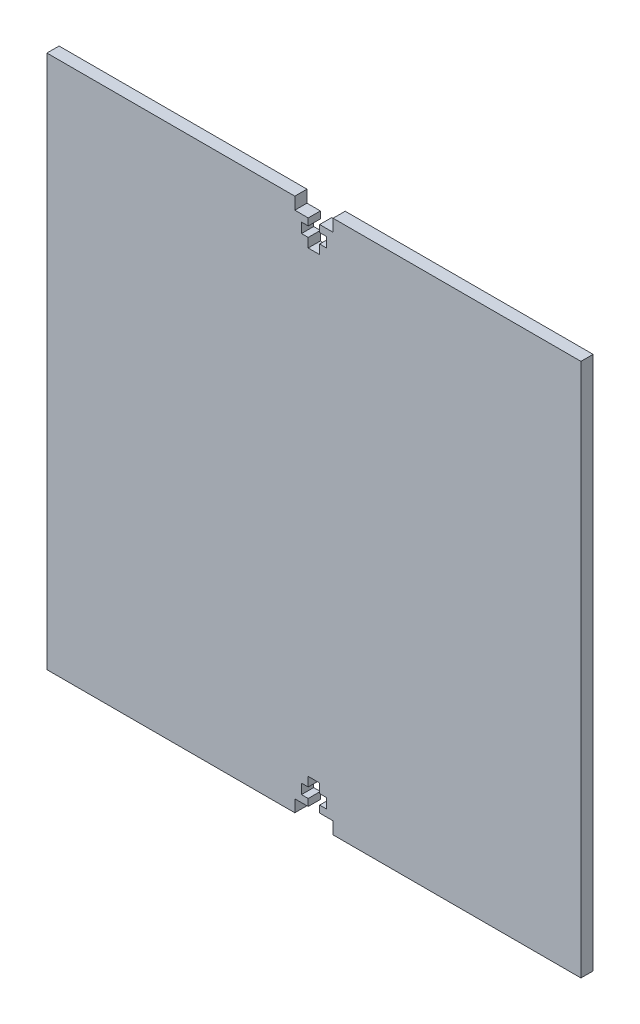
ISO-10303-21;
HEADER;
FILE_DESCRIPTION(('STEP AP214'),'2;1');
FILE_NAME('part.step','',(''),(''),'','','');
FILE_SCHEMA(('AUTOMOTIVE_DESIGN { 1 0 10303 214 1 1 1 1 }'));
ENDSEC;
DATA;
#1=APPLICATION_CONTEXT('core data for automotive mechanical design processes');
#2=APPLICATION_PROTOCOL_DEFINITION('international standard','automotive_design',2000,#1);
#3=PRODUCT_CONTEXT('',#1,'mechanical');
#4=PRODUCT('Part','Part','',(#3));
#5=PRODUCT_RELATED_PRODUCT_CATEGORY('part','',(#4));
#6=PRODUCT_DEFINITION_FORMATION('','',#4);
#7=PRODUCT_DEFINITION_CONTEXT('part definition',#1,'design');
#8=PRODUCT_DEFINITION('design','',#6,#7);
#9=PRODUCT_DEFINITION_SHAPE('','',#8);
#10=(LENGTH_UNIT() NAMED_UNIT(*) SI_UNIT(.MILLI.,.METRE.));
#11=(NAMED_UNIT(*) PLANE_ANGLE_UNIT() SI_UNIT($,.RADIAN.));
#12=(NAMED_UNIT(*) SI_UNIT($,.STERADIAN.) SOLID_ANGLE_UNIT());
#13=UNCERTAINTY_MEASURE_WITH_UNIT(LENGTH_MEASURE(1.E-05),#10,'distance_accuracy_value','');
#14=(GEOMETRIC_REPRESENTATION_CONTEXT(3) GLOBAL_UNCERTAINTY_ASSIGNED_CONTEXT((#13)) GLOBAL_UNIT_ASSIGNED_CONTEXT((#10,
#11,#12)) REPRESENTATION_CONTEXT('',''));
#15=CARTESIAN_POINT('',(0.,0.,0.));
#16=DIRECTION('',(0.,0.,1.));
#17=DIRECTION('',(1.,0.,0.));
#18=AXIS2_PLACEMENT_3D('',#15,#16,#17);
#19=CARTESIAN_POINT('',(-69.85,-69.85,3.18));
#20=DIRECTION('',(0.,1.,0.));
#21=DIRECTION('',(0.,0.,1.));
#22=AXIS2_PLACEMENT_3D('',#19,#20,#21);
#23=PLANE('',#22);
#24=DIRECTION('',(1.,0.,0.));
#25=VECTOR('',#24,1.);
#26=CARTESIAN_POINT('',(-69.85,-69.85,3.18));
#27=LINE('',#26,#25);
#28=CARTESIAN_POINT('',(4.99999999999998,-69.85,3.18));
#29=VERTEX_POINT('',#28);
#30=CARTESIAN_POINT('',(69.85,-69.85,3.18));
#31=VERTEX_POINT('',#30);
#32=EDGE_CURVE('E530',#29,#31,#27,.T.);
#33=ORIENTED_EDGE('',*,*,#32,.F.);
#34=DIRECTION('',(0.,0.,1.));
#35=VECTOR('',#34,1.);
#36=CARTESIAN_POINT('',(4.99999999999998,-69.85,0.));
#37=LINE('',#36,#35);
#38=CARTESIAN_POINT('',(4.99999999999998,-69.85,0.));
#39=VERTEX_POINT('',#38);
#40=EDGE_CURVE('E369',#39,#29,#37,.T.);
#41=ORIENTED_EDGE('',*,*,#40,.F.);
#42=DIRECTION('',(1.,0.,0.));
#43=VECTOR('',#42,1.);
#44=CARTESIAN_POINT('',(-69.85,-69.85,0.));
#45=LINE('',#44,#43);
#46=CARTESIAN_POINT('',(69.85,-69.85,0.));
#47=VERTEX_POINT('',#46);
#48=EDGE_CURVE('E289',#39,#47,#45,.T.);
#49=ORIENTED_EDGE('',*,*,#48,.T.);
#50=DIRECTION('',(0.,0.,-1.));
#51=VECTOR('',#50,1.);
#52=CARTESIAN_POINT('',(69.85,-69.85,3.18));
#53=LINE('',#52,#51);
#54=EDGE_CURVE('E534',#31,#47,#53,.T.);
#55=ORIENTED_EDGE('',*,*,#54,.F.);
#56=EDGE_LOOP('',(#33,#41,#49,#55));
#57=FACE_BOUND('',#56,.T.);
#58=ADVANCED_FACE('F35',(#57),#23,.F.);
#59=CARTESIAN_POINT('',(-69.85,69.85,3.18));
#60=DIRECTION('',(0.,-1.,0.));
#61=DIRECTION('',(0.,0.,-1.));
#62=AXIS2_PLACEMENT_3D('',#59,#60,#61);
#63=PLANE('',#62);
#64=DIRECTION('',(-1.,0.,0.));
#65=VECTOR('',#64,1.);
#66=CARTESIAN_POINT('',(-69.85,69.85,0.));
#67=LINE('',#66,#65);
#68=CARTESIAN_POINT('',(69.85,69.85,0.));
#69=VERTEX_POINT('',#68);
#70=CARTESIAN_POINT('',(4.99999999999999,69.85,0.));
#71=VERTEX_POINT('',#70);
#72=EDGE_CURVE('E538',#69,#71,#67,.T.);
#73=ORIENTED_EDGE('',*,*,#72,.T.);
#74=DIRECTION('',(0.,0.,-1.));
#75=VECTOR('',#74,1.);
#76=CARTESIAN_POINT('',(4.99999999999999,69.85,3.18));
#77=LINE('',#76,#75);
#78=CARTESIAN_POINT('',(4.99999999999999,69.85,3.18));
#79=VERTEX_POINT('',#78);
#80=EDGE_CURVE('E487',#79,#71,#77,.T.);
#81=ORIENTED_EDGE('',*,*,#80,.F.);
#82=DIRECTION('',(-1.,0.,0.));
#83=VECTOR('',#82,1.);
#84=CARTESIAN_POINT('',(-69.85,69.85,3.18));
#85=LINE('',#84,#83);
#86=CARTESIAN_POINT('',(69.85,69.85,3.18));
#87=VERTEX_POINT('',#86);
#88=EDGE_CURVE('E525',#87,#79,#85,.T.);
#89=ORIENTED_EDGE('',*,*,#88,.F.);
#90=DIRECTION('',(0.,0.,-1.));
#91=VECTOR('',#90,1.);
#92=CARTESIAN_POINT('',(69.85,69.85,3.18));
#93=LINE('',#92,#91);
#94=EDGE_CURVE('E11',#87,#69,#93,.T.);
#95=ORIENTED_EDGE('',*,*,#94,.T.);
#96=EDGE_LOOP('',(#73,#81,#89,#95));
#97=FACE_BOUND('',#96,.T.);
#98=ADVANCED_FACE('F628',(#97),#63,.F.);
#99=CARTESIAN_POINT('',(69.85,69.85,3.18));
#100=DIRECTION('',(-1.,0.,0.));
#101=DIRECTION('',(0.,-1.,0.));
#102=AXIS2_PLACEMENT_3D('',#99,#100,#101);
#103=PLANE('',#102);
#104=DIRECTION('',(0.,1.,0.));
#105=VECTOR('',#104,1.);
#106=CARTESIAN_POINT('',(69.85,69.85,0.));
#107=LINE('',#106,#105);
#108=EDGE_CURVE('E489',#47,#69,#107,.T.);
#109=ORIENTED_EDGE('',*,*,#108,.T.);
#110=ORIENTED_EDGE('',*,*,#94,.F.);
#111=DIRECTION('',(0.,1.,0.));
#112=VECTOR('',#111,1.);
#113=CARTESIAN_POINT('',(69.85,69.85,3.18));
#114=LINE('',#113,#112);
#115=EDGE_CURVE('E520',#31,#87,#114,.T.);
#116=ORIENTED_EDGE('',*,*,#115,.F.);
#117=ORIENTED_EDGE('',*,*,#54,.T.);
#118=EDGE_LOOP('',(#109,#110,#116,#117));
#119=FACE_BOUND('',#118,.T.);
#120=ADVANCED_FACE('F37',(#119),#103,.F.);
#121=CARTESIAN_POINT('',(-5.00000000000001,69.85,3.18));
#122=VERTEX_POINT('',#121);
#123=CARTESIAN_POINT('',(-69.85,69.85,3.18));
#124=VERTEX_POINT('',#123);
#125=EDGE_CURVE('E523',#122,#124,#85,.T.);
#126=ORIENTED_EDGE('',*,*,#125,.F.);
#127=DIRECTION('',(0.,0.,-1.));
#128=VECTOR('',#127,1.);
#129=CARTESIAN_POINT('',(-5.00000000000001,69.85,3.18));
#130=LINE('',#129,#128);
#131=CARTESIAN_POINT('',(-5.00000000000001,69.85,0.));
#132=VERTEX_POINT('',#131);
#133=EDGE_CURVE('E490',#122,#132,#130,.T.);
#134=ORIENTED_EDGE('',*,*,#133,.T.);
#135=CARTESIAN_POINT('',(-69.85,69.85,0.));
#136=VERTEX_POINT('',#135);
#137=EDGE_CURVE('E537',#132,#136,#67,.T.);
#138=ORIENTED_EDGE('',*,*,#137,.T.);
#139=DIRECTION('',(0.,0.,-1.));
#140=VECTOR('',#139,1.);
#141=CARTESIAN_POINT('',(-69.85,69.85,3.18));
#142=LINE('',#141,#140);
#143=EDGE_CURVE('E43',#124,#136,#142,.T.);
#144=ORIENTED_EDGE('',*,*,#143,.F.);
#145=EDGE_LOOP('',(#126,#134,#138,#144));
#146=FACE_BOUND('',#145,.T.);
#147=ADVANCED_FACE('F570',(#146),#63,.F.);
#148=CARTESIAN_POINT('',(-69.85,69.85,3.18));
#149=DIRECTION('',(1.,0.,0.));
#150=DIRECTION('',(0.,1.,0.));
#151=AXIS2_PLACEMENT_3D('',#148,#149,#150);
#152=PLANE('',#151);
#153=DIRECTION('',(0.,-1.,0.));
#154=VECTOR('',#153,1.);
#155=CARTESIAN_POINT('',(-69.85,69.85,0.));
#156=LINE('',#155,#154);
#157=CARTESIAN_POINT('',(-69.85,-69.85,0.));
#158=VERTEX_POINT('',#157);
#159=EDGE_CURVE('E541',#136,#158,#156,.T.);
#160=ORIENTED_EDGE('',*,*,#159,.T.);
#161=DIRECTION('',(0.,0.,-1.));
#162=VECTOR('',#161,1.);
#163=CARTESIAN_POINT('',(-69.85,-69.85,3.18));
#164=LINE('',#163,#162);
#165=CARTESIAN_POINT('',(-69.85,-69.85,3.18));
#166=VERTEX_POINT('',#165);
#167=EDGE_CURVE('E547',#166,#158,#164,.T.);
#168=ORIENTED_EDGE('',*,*,#167,.F.);
#169=DIRECTION('',(0.,-1.,0.));
#170=VECTOR('',#169,1.);
#171=CARTESIAN_POINT('',(-69.85,69.85,3.18));
#172=LINE('',#171,#170);
#173=EDGE_CURVE('E528',#124,#166,#172,.T.);
#174=ORIENTED_EDGE('',*,*,#173,.F.);
#175=ORIENTED_EDGE('',*,*,#143,.T.);
#176=EDGE_LOOP('',(#160,#168,#174,#175));
#177=FACE_BOUND('',#176,.T.);
#178=ADVANCED_FACE('F554',(#177),#152,.F.);
#179=CARTESIAN_POINT('',(-4.99999999999999,-69.85,0.));
#180=VERTEX_POINT('',#179);
#181=EDGE_CURVE('E524',#158,#180,#45,.T.);
#182=ORIENTED_EDGE('',*,*,#181,.T.);
#183=DIRECTION('',(0.,0.,1.));
#184=VECTOR('',#183,1.);
#185=CARTESIAN_POINT('',(-4.99999999999999,-69.85,0.));
#186=LINE('',#185,#184);
#187=CARTESIAN_POINT('',(-4.99999999999999,-69.85,3.18));
#188=VERTEX_POINT('',#187);
#189=EDGE_CURVE('E371',#180,#188,#186,.T.);
#190=ORIENTED_EDGE('',*,*,#189,.T.);
#191=EDGE_CURVE('E531',#166,#188,#27,.T.);
#192=ORIENTED_EDGE('',*,*,#191,.F.);
#193=ORIENTED_EDGE('',*,*,#167,.T.);
#194=EDGE_LOOP('',(#182,#190,#192,#193));
#195=FACE_BOUND('',#194,.T.);
#196=ADVANCED_FACE('F563',(#195),#23,.F.);
#197=CARTESIAN_POINT('',(0.,0.,3.18));
#198=DIRECTION('',(0.,0.,1.));
#199=DIRECTION('',(1.,0.,0.));
#200=AXIS2_PLACEMENT_3D('',#197,#198,#199);
#201=PLANE('',#200);
#202=DIRECTION('',(0.,1.,0.));
#203=VECTOR('',#202,1.);
#204=CARTESIAN_POINT('',(4.99999999999998,-69.85,3.18));
#205=LINE('',#204,#203);
#206=CARTESIAN_POINT('',(4.99999999999999,-66.67,3.18));
#207=VERTEX_POINT('',#206);
#208=EDGE_CURVE('E274',#29,#207,#205,.T.);
#209=ORIENTED_EDGE('',*,*,#208,.F.);
#210=ORIENTED_EDGE('',*,*,#32,.T.);
#211=ORIENTED_EDGE('',*,*,#115,.T.);
#212=ORIENTED_EDGE('',*,*,#88,.T.);
#213=DIRECTION('',(0.,-1.,0.));
#214=VECTOR('',#213,1.);
#215=CARTESIAN_POINT('',(4.99999999999999,69.85,3.18));
#216=LINE('',#215,#214);
#217=CARTESIAN_POINT('',(4.99999999999999,66.67,3.18));
#218=VERTEX_POINT('',#217);
#219=EDGE_CURVE('E399',#79,#218,#216,.T.);
#220=ORIENTED_EDGE('',*,*,#219,.T.);
#221=DIRECTION('',(-1.,0.,0.));
#222=VECTOR('',#221,1.);
#223=CARTESIAN_POINT('',(4.99999999999999,66.67,3.18));
#224=LINE('',#223,#222);
#225=CARTESIAN_POINT('',(1.49999999999999,66.67,3.18));
#226=VERTEX_POINT('',#225);
#227=EDGE_CURVE('E402',#218,#226,#224,.T.);
#228=ORIENTED_EDGE('',*,*,#227,.T.);
#229=DIRECTION('',(0.,-1.,0.));
#230=VECTOR('',#229,1.);
#231=CARTESIAN_POINT('',(1.49999999999999,66.67,3.18));
#232=LINE('',#231,#230);
#233=CARTESIAN_POINT('',(1.49999999999999,64.85,3.18));
#234=VERTEX_POINT('',#233);
#235=EDGE_CURVE('E406',#226,#234,#232,.T.);
#236=ORIENTED_EDGE('',*,*,#235,.T.);
#237=DIRECTION('',(1.,0.,0.));
#238=VECTOR('',#237,1.);
#239=CARTESIAN_POINT('',(3.24999999999999,64.85,3.18));
#240=LINE('',#239,#238);
#241=CARTESIAN_POINT('',(3.24999999999999,64.85,3.18));
#242=VERTEX_POINT('',#241);
#243=EDGE_CURVE('E409',#234,#242,#240,.T.);
#244=ORIENTED_EDGE('',*,*,#243,.T.);
#245=DIRECTION('',(0.,-1.,0.));
#246=VECTOR('',#245,1.);
#247=CARTESIAN_POINT('',(3.24999999999999,64.85,3.18));
#248=LINE('',#247,#246);
#249=CARTESIAN_POINT('',(3.24999999999999,62.25,3.18));
#250=VERTEX_POINT('',#249);
#251=EDGE_CURVE('E412',#242,#250,#248,.T.);
#252=ORIENTED_EDGE('',*,*,#251,.T.);
#253=DIRECTION('',(-1.,0.,0.));
#254=VECTOR('',#253,1.);
#255=CARTESIAN_POINT('',(3.24999999999999,62.25,3.18));
#256=LINE('',#255,#254);
#257=CARTESIAN_POINT('',(1.49999999999999,62.25,3.18));
#258=VERTEX_POINT('',#257);
#259=EDGE_CURVE('E415',#250,#258,#256,.T.);
#260=ORIENTED_EDGE('',*,*,#259,.T.);
#261=DIRECTION('',(0.,-1.,0.));
#262=VECTOR('',#261,1.);
#263=CARTESIAN_POINT('',(1.49999999999999,62.25,3.18));
#264=LINE('',#263,#262);
#265=CARTESIAN_POINT('',(1.49999999999999,59.85,3.18));
#266=VERTEX_POINT('',#265);
#267=EDGE_CURVE('E418',#258,#266,#264,.T.);
#268=ORIENTED_EDGE('',*,*,#267,.T.);
#269=DIRECTION('',(-1.,0.,0.));
#270=VECTOR('',#269,1.);
#271=CARTESIAN_POINT('',(1.49999999999999,59.85,3.18));
#272=LINE('',#271,#270);
#273=CARTESIAN_POINT('',(-1.50000000000001,59.85,3.18));
#274=VERTEX_POINT('',#273);
#275=EDGE_CURVE('E421',#266,#274,#272,.T.);
#276=ORIENTED_EDGE('',*,*,#275,.T.);
#277=DIRECTION('',(0.,1.,0.));
#278=VECTOR('',#277,1.);
#279=CARTESIAN_POINT('',(-1.50000000000001,62.25,3.18));
#280=LINE('',#279,#278);
#281=CARTESIAN_POINT('',(-1.50000000000001,62.25,3.18));
#282=VERTEX_POINT('',#281);
#283=EDGE_CURVE('E424',#274,#282,#280,.T.);
#284=ORIENTED_EDGE('',*,*,#283,.T.);
#285=DIRECTION('',(-1.,0.,0.));
#286=VECTOR('',#285,1.);
#287=CARTESIAN_POINT('',(-1.50000000000001,62.25,3.18));
#288=LINE('',#287,#286);
#289=CARTESIAN_POINT('',(-3.25000000000001,62.25,3.18));
#290=VERTEX_POINT('',#289);
#291=EDGE_CURVE('E427',#282,#290,#288,.T.);
#292=ORIENTED_EDGE('',*,*,#291,.T.);
#293=DIRECTION('',(0.,1.,0.));
#294=VECTOR('',#293,1.);
#295=CARTESIAN_POINT('',(-3.25000000000001,64.85,3.18));
#296=LINE('',#295,#294);
#297=CARTESIAN_POINT('',(-3.25000000000001,64.85,3.18));
#298=VERTEX_POINT('',#297);
#299=EDGE_CURVE('E430',#290,#298,#296,.T.);
#300=ORIENTED_EDGE('',*,*,#299,.T.);
#301=DIRECTION('',(1.,0.,0.));
#302=VECTOR('',#301,1.);
#303=CARTESIAN_POINT('',(-3.25000000000001,64.85,3.18));
#304=LINE('',#303,#302);
#305=CARTESIAN_POINT('',(-1.50000000000001,64.85,3.18));
#306=VERTEX_POINT('',#305);
#307=EDGE_CURVE('E433',#298,#306,#304,.T.);
#308=ORIENTED_EDGE('',*,*,#307,.T.);
#309=DIRECTION('',(0.,1.,0.));
#310=VECTOR('',#309,1.);
#311=CARTESIAN_POINT('',(-1.50000000000001,66.67,3.18));
#312=LINE('',#311,#310);
#313=CARTESIAN_POINT('',(-1.50000000000001,66.67,3.18));
#314=VERTEX_POINT('',#313);
#315=EDGE_CURVE('E436',#306,#314,#312,.T.);
#316=ORIENTED_EDGE('',*,*,#315,.T.);
#317=DIRECTION('',(-1.,0.,0.));
#318=VECTOR('',#317,1.);
#319=CARTESIAN_POINT('',(-1.50000000000001,66.67,3.18));
#320=LINE('',#319,#318);
#321=CARTESIAN_POINT('',(-5.00000000000001,66.67,3.18));
#322=VERTEX_POINT('',#321);
#323=EDGE_CURVE('E439',#314,#322,#320,.T.);
#324=ORIENTED_EDGE('',*,*,#323,.T.);
#325=DIRECTION('',(0.,1.,0.));
#326=VECTOR('',#325,1.);
#327=CARTESIAN_POINT('',(-5.00000000000001,69.85,3.18));
#328=LINE('',#327,#326);
#329=EDGE_CURVE('E442',#322,#122,#328,.T.);
#330=ORIENTED_EDGE('',*,*,#329,.T.);
#331=ORIENTED_EDGE('',*,*,#125,.T.);
#332=ORIENTED_EDGE('',*,*,#173,.T.);
#333=ORIENTED_EDGE('',*,*,#191,.T.);
#334=DIRECTION('',(0.,-1.,0.));
#335=VECTOR('',#334,1.);
#336=CARTESIAN_POINT('',(-4.99999999999999,-69.85,3.18));
#337=LINE('',#336,#335);
#338=CARTESIAN_POINT('',(-5.00000000000001,-66.67,3.18));
#339=VERTEX_POINT('',#338);
#340=EDGE_CURVE('E290',#339,#188,#337,.T.);
#341=ORIENTED_EDGE('',*,*,#340,.F.);
#342=DIRECTION('',(-1.,0.,0.));
#343=VECTOR('',#342,1.);
#344=CARTESIAN_POINT('',(-1.5,-66.67,3.18));
#345=LINE('',#344,#343);
#346=CARTESIAN_POINT('',(-1.5,-66.67,3.18));
#347=VERTEX_POINT('',#346);
#348=EDGE_CURVE('E292',#347,#339,#345,.T.);
#349=ORIENTED_EDGE('',*,*,#348,.F.);
#350=DIRECTION('',(0.,-1.,0.));
#351=VECTOR('',#350,1.);
#352=CARTESIAN_POINT('',(-1.5,-66.67,3.18));
#353=LINE('',#352,#351);
#354=CARTESIAN_POINT('',(-1.5,-64.85,3.18));
#355=VERTEX_POINT('',#354);
#356=EDGE_CURVE('E364',#355,#347,#353,.T.);
#357=ORIENTED_EDGE('',*,*,#356,.F.);
#358=DIRECTION('',(1.,0.,0.));
#359=VECTOR('',#358,1.);
#360=CARTESIAN_POINT('',(-3.25,-64.85,3.18));
#361=LINE('',#360,#359);
#362=CARTESIAN_POINT('',(-3.25,-64.85,3.18));
#363=VERTEX_POINT('',#362);
#364=EDGE_CURVE('E361',#363,#355,#361,.T.);
#365=ORIENTED_EDGE('',*,*,#364,.F.);
#366=DIRECTION('',(0.,-1.,0.));
#367=VECTOR('',#366,1.);
#368=CARTESIAN_POINT('',(-3.25,-64.85,3.18));
#369=LINE('',#368,#367);
#370=CARTESIAN_POINT('',(-3.25,-62.25,3.18));
#371=VERTEX_POINT('',#370);
#372=EDGE_CURVE('E358',#371,#363,#369,.T.);
#373=ORIENTED_EDGE('',*,*,#372,.F.);
#374=DIRECTION('',(-1.,0.,0.));
#375=VECTOR('',#374,1.);
#376=CARTESIAN_POINT('',(-1.5,-62.25,3.18));
#377=LINE('',#376,#375);
#378=CARTESIAN_POINT('',(-1.5,-62.25,3.18));
#379=VERTEX_POINT('',#378);
#380=EDGE_CURVE('E355',#379,#371,#377,.T.);
#381=ORIENTED_EDGE('',*,*,#380,.F.);
#382=DIRECTION('',(0.,-1.,0.));
#383=VECTOR('',#382,1.);
#384=CARTESIAN_POINT('',(-1.5,-62.25,3.18));
#385=LINE('',#384,#383);
#386=CARTESIAN_POINT('',(-1.5,-59.85,3.18));
#387=VERTEX_POINT('',#386);
#388=EDGE_CURVE('E352',#387,#379,#385,.T.);
#389=ORIENTED_EDGE('',*,*,#388,.F.);
#390=DIRECTION('',(-1.,0.,0.));
#391=VECTOR('',#390,1.);
#392=CARTESIAN_POINT('',(1.5,-59.85,3.18));
#393=LINE('',#392,#391);
#394=CARTESIAN_POINT('',(1.5,-59.85,3.18));
#395=VERTEX_POINT('',#394);
#396=EDGE_CURVE('E349',#395,#387,#393,.T.);
#397=ORIENTED_EDGE('',*,*,#396,.F.);
#398=DIRECTION('',(0.,1.,0.));
#399=VECTOR('',#398,1.);
#400=CARTESIAN_POINT('',(1.5,-62.25,3.18));
#401=LINE('',#400,#399);
#402=CARTESIAN_POINT('',(1.5,-62.25,3.18));
#403=VERTEX_POINT('',#402);
#404=EDGE_CURVE('E346',#403,#395,#401,.T.);
#405=ORIENTED_EDGE('',*,*,#404,.F.);
#406=DIRECTION('',(-1.,0.,0.));
#407=VECTOR('',#406,1.);
#408=CARTESIAN_POINT('',(3.25,-62.25,3.18));
#409=LINE('',#408,#407);
#410=CARTESIAN_POINT('',(3.25,-62.25,3.18));
#411=VERTEX_POINT('',#410);
#412=EDGE_CURVE('E343',#411,#403,#409,.T.);
#413=ORIENTED_EDGE('',*,*,#412,.F.);
#414=DIRECTION('',(0.,1.,0.));
#415=VECTOR('',#414,1.);
#416=CARTESIAN_POINT('',(3.24999999999999,-64.85,3.18));
#417=LINE('',#416,#415);
#418=CARTESIAN_POINT('',(3.24999999999999,-64.85,3.18));
#419=VERTEX_POINT('',#418);
#420=EDGE_CURVE('E340',#419,#411,#417,.T.);
#421=ORIENTED_EDGE('',*,*,#420,.F.);
#422=DIRECTION('',(1.,0.,0.));
#423=VECTOR('',#422,1.);
#424=CARTESIAN_POINT('',(3.24999999999999,-64.85,3.18));
#425=LINE('',#424,#423);
#426=CARTESIAN_POINT('',(1.5,-64.85,3.18));
#427=VERTEX_POINT('',#426);
#428=EDGE_CURVE('E337',#427,#419,#425,.T.);
#429=ORIENTED_EDGE('',*,*,#428,.F.);
#430=DIRECTION('',(0.,1.,0.));
#431=VECTOR('',#430,1.);
#432=CARTESIAN_POINT('',(1.5,-66.67,3.18));
#433=LINE('',#432,#431);
#434=CARTESIAN_POINT('',(1.5,-66.67,3.18));
#435=VERTEX_POINT('',#434);
#436=EDGE_CURVE('E334',#435,#427,#433,.T.);
#437=ORIENTED_EDGE('',*,*,#436,.F.);
#438=DIRECTION('',(-1.,0.,0.));
#439=VECTOR('',#438,1.);
#440=CARTESIAN_POINT('',(4.99999999999999,-66.67,3.18));
#441=LINE('',#440,#439);
#442=EDGE_CURVE('E332',#207,#435,#441,.T.);
#443=ORIENTED_EDGE('',*,*,#442,.F.);
#444=EDGE_LOOP('',(#209,#210,#211,#212,#220,#228,#236,#244,#252,#260,#268,#276,#284,#292,#300,
#308,#316,#324,#330,#331,#332,#333,#341,#349,#357,#365,#373,#381,#389,#397,#405,#413,#421,#429,
#437,#443));
#445=FACE_BOUND('',#444,.T.);
#446=ADVANCED_FACE('F567',(#445),#201,.T.);
#447=CARTESIAN_POINT('',(0.,0.,0.));
#448=DIRECTION('',(0.,0.,1.));
#449=DIRECTION('',(1.,0.,0.));
#450=AXIS2_PLACEMENT_3D('',#447,#448,#449);
#451=PLANE('',#450);
#452=ORIENTED_EDGE('',*,*,#48,.F.);
#453=DIRECTION('',(0.,1.,0.));
#454=VECTOR('',#453,1.);
#455=CARTESIAN_POINT('',(4.99999999999998,-69.85,0.));
#456=LINE('',#455,#454);
#457=CARTESIAN_POINT('',(4.99999999999999,-66.67,0.));
#458=VERTEX_POINT('',#457);
#459=EDGE_CURVE('E271',#39,#458,#456,.T.);
#460=ORIENTED_EDGE('',*,*,#459,.T.);
#461=DIRECTION('',(-1.,0.,0.));
#462=VECTOR('',#461,1.);
#463=CARTESIAN_POINT('',(4.99999999999999,-66.67,0.));
#464=LINE('',#463,#462);
#465=CARTESIAN_POINT('',(1.5,-66.67,0.));
#466=VERTEX_POINT('',#465);
#467=EDGE_CURVE('E282',#458,#466,#464,.T.);
#468=ORIENTED_EDGE('',*,*,#467,.T.);
#469=DIRECTION('',(0.,1.,0.));
#470=VECTOR('',#469,1.);
#471=CARTESIAN_POINT('',(1.5,-66.67,0.));
#472=LINE('',#471,#470);
#473=CARTESIAN_POINT('',(1.5,-64.85,0.));
#474=VERTEX_POINT('',#473);
#475=EDGE_CURVE('E50',#466,#474,#472,.T.);
#476=ORIENTED_EDGE('',*,*,#475,.T.);
#477=DIRECTION('',(1.,0.,0.));
#478=VECTOR('',#477,1.);
#479=CARTESIAN_POINT('',(3.24999999999999,-64.85,0.));
#480=LINE('',#479,#478);
#481=CARTESIAN_POINT('',(3.24999999999999,-64.85,0.));
#482=VERTEX_POINT('',#481);
#483=EDGE_CURVE('E296',#474,#482,#480,.T.);
#484=ORIENTED_EDGE('',*,*,#483,.T.);
#485=DIRECTION('',(0.,1.,0.));
#486=VECTOR('',#485,1.);
#487=CARTESIAN_POINT('',(3.24999999999999,-64.85,0.));
#488=LINE('',#487,#486);
#489=CARTESIAN_POINT('',(3.25,-62.25,0.));
#490=VERTEX_POINT('',#489);
#491=EDGE_CURVE('E299',#482,#490,#488,.T.);
#492=ORIENTED_EDGE('',*,*,#491,.T.);
#493=DIRECTION('',(-1.,0.,0.));
#494=VECTOR('',#493,1.);
#495=CARTESIAN_POINT('',(3.25,-62.25,0.));
#496=LINE('',#495,#494);
#497=CARTESIAN_POINT('',(1.5,-62.25,0.));
#498=VERTEX_POINT('',#497);
#499=EDGE_CURVE('E302',#490,#498,#496,.T.);
#500=ORIENTED_EDGE('',*,*,#499,.T.);
#501=DIRECTION('',(0.,1.,0.));
#502=VECTOR('',#501,1.);
#503=CARTESIAN_POINT('',(1.5,-62.25,0.));
#504=LINE('',#503,#502);
#505=CARTESIAN_POINT('',(1.5,-59.85,0.));
#506=VERTEX_POINT('',#505);
#507=EDGE_CURVE('E305',#498,#506,#504,.T.);
#508=ORIENTED_EDGE('',*,*,#507,.T.);
#509=DIRECTION('',(-1.,0.,0.));
#510=VECTOR('',#509,1.);
#511=CARTESIAN_POINT('',(1.5,-59.85,0.));
#512=LINE('',#511,#510);
#513=CARTESIAN_POINT('',(-1.5,-59.85,0.));
#514=VERTEX_POINT('',#513);
#515=EDGE_CURVE('E308',#506,#514,#512,.T.);
#516=ORIENTED_EDGE('',*,*,#515,.T.);
#517=DIRECTION('',(0.,-1.,0.));
#518=VECTOR('',#517,1.);
#519=CARTESIAN_POINT('',(-1.5,-62.25,0.));
#520=LINE('',#519,#518);
#521=CARTESIAN_POINT('',(-1.5,-62.25,0.));
#522=VERTEX_POINT('',#521);
#523=EDGE_CURVE('E311',#514,#522,#520,.T.);
#524=ORIENTED_EDGE('',*,*,#523,.T.);
#525=DIRECTION('',(-1.,0.,0.));
#526=VECTOR('',#525,1.);
#527=CARTESIAN_POINT('',(-1.5,-62.25,0.));
#528=LINE('',#527,#526);
#529=CARTESIAN_POINT('',(-3.25,-62.25,0.));
#530=VERTEX_POINT('',#529);
#531=EDGE_CURVE('E314',#522,#530,#528,.T.);
#532=ORIENTED_EDGE('',*,*,#531,.T.);
#533=DIRECTION('',(0.,-1.,0.));
#534=VECTOR('',#533,1.);
#535=CARTESIAN_POINT('',(-3.25,-64.85,0.));
#536=LINE('',#535,#534);
#537=CARTESIAN_POINT('',(-3.25,-64.85,0.));
#538=VERTEX_POINT('',#537);
#539=EDGE_CURVE('E317',#530,#538,#536,.T.);
#540=ORIENTED_EDGE('',*,*,#539,.T.);
#541=DIRECTION('',(1.,0.,0.));
#542=VECTOR('',#541,1.);
#543=CARTESIAN_POINT('',(-3.25,-64.85,0.));
#544=LINE('',#543,#542);
#545=CARTESIAN_POINT('',(-1.5,-64.85,0.));
#546=VERTEX_POINT('',#545);
#547=EDGE_CURVE('E320',#538,#546,#544,.T.);
#548=ORIENTED_EDGE('',*,*,#547,.T.);
#549=DIRECTION('',(0.,-1.,0.));
#550=VECTOR('',#549,1.);
#551=CARTESIAN_POINT('',(-1.5,-66.67,0.));
#552=LINE('',#551,#550);
#553=CARTESIAN_POINT('',(-1.5,-66.67,0.));
#554=VERTEX_POINT('',#553);
#555=EDGE_CURVE('E323',#546,#554,#552,.T.);
#556=ORIENTED_EDGE('',*,*,#555,.T.);
#557=DIRECTION('',(-1.,0.,0.));
#558=VECTOR('',#557,1.);
#559=CARTESIAN_POINT('',(-1.5,-66.67,0.));
#560=LINE('',#559,#558);
#561=CARTESIAN_POINT('',(-5.00000000000001,-66.67,0.));
#562=VERTEX_POINT('',#561);
#563=EDGE_CURVE('E326',#554,#562,#560,.T.);
#564=ORIENTED_EDGE('',*,*,#563,.T.);
#565=DIRECTION('',(0.,-1.,0.));
#566=VECTOR('',#565,1.);
#567=CARTESIAN_POINT('',(-4.99999999999999,-69.85,0.));
#568=LINE('',#567,#566);
#569=EDGE_CURVE('E279',#562,#180,#568,.T.);
#570=ORIENTED_EDGE('',*,*,#569,.T.);
#571=ORIENTED_EDGE('',*,*,#181,.F.);
#572=ORIENTED_EDGE('',*,*,#159,.F.);
#573=ORIENTED_EDGE('',*,*,#137,.F.);
#574=DIRECTION('',(0.,1.,0.));
#575=VECTOR('',#574,1.);
#576=CARTESIAN_POINT('',(-5.00000000000001,69.85,0.));
#577=LINE('',#576,#575);
#578=CARTESIAN_POINT('',(-5.00000000000001,66.67,0.));
#579=VERTEX_POINT('',#578);
#580=EDGE_CURVE('E403',#579,#132,#577,.T.);
#581=ORIENTED_EDGE('',*,*,#580,.F.);
#582=DIRECTION('',(-1.,0.,0.));
#583=VECTOR('',#582,1.);
#584=CARTESIAN_POINT('',(-1.50000000000001,66.67,0.));
#585=LINE('',#584,#583);
#586=CARTESIAN_POINT('',(-1.50000000000001,66.67,0.));
#587=VERTEX_POINT('',#586);
#588=EDGE_CURVE('E483',#587,#579,#585,.T.);
#589=ORIENTED_EDGE('',*,*,#588,.F.);
#590=DIRECTION('',(0.,1.,0.));
#591=VECTOR('',#590,1.);
#592=CARTESIAN_POINT('',(-1.50000000000001,66.67,0.));
#593=LINE('',#592,#591);
#594=CARTESIAN_POINT('',(-1.50000000000001,64.85,0.));
#595=VERTEX_POINT('',#594);
#596=EDGE_CURVE('E480',#595,#587,#593,.T.);
#597=ORIENTED_EDGE('',*,*,#596,.F.);
#598=DIRECTION('',(1.,0.,0.));
#599=VECTOR('',#598,1.);
#600=CARTESIAN_POINT('',(-3.25000000000001,64.85,0.));
#601=LINE('',#600,#599);
#602=CARTESIAN_POINT('',(-3.25000000000001,64.85,0.));
#603=VERTEX_POINT('',#602);
#604=EDGE_CURVE('E477',#603,#595,#601,.T.);
#605=ORIENTED_EDGE('',*,*,#604,.F.);
#606=DIRECTION('',(0.,1.,0.));
#607=VECTOR('',#606,1.);
#608=CARTESIAN_POINT('',(-3.25000000000001,64.85,0.));
#609=LINE('',#608,#607);
#610=CARTESIAN_POINT('',(-3.25000000000001,62.25,0.));
#611=VERTEX_POINT('',#610);
#612=EDGE_CURVE('E474',#611,#603,#609,.T.);
#613=ORIENTED_EDGE('',*,*,#612,.F.);
#614=DIRECTION('',(-1.,0.,0.));
#615=VECTOR('',#614,1.);
#616=CARTESIAN_POINT('',(-1.50000000000001,62.25,0.));
#617=LINE('',#616,#615);
#618=CARTESIAN_POINT('',(-1.50000000000001,62.25,0.));
#619=VERTEX_POINT('',#618);
#620=EDGE_CURVE('E471',#619,#611,#617,.T.);
#621=ORIENTED_EDGE('',*,*,#620,.F.);
#622=DIRECTION('',(0.,1.,0.));
#623=VECTOR('',#622,1.);
#624=CARTESIAN_POINT('',(-1.50000000000001,62.25,0.));
#625=LINE('',#624,#623);
#626=CARTESIAN_POINT('',(-1.50000000000001,59.85,0.));
#627=VERTEX_POINT('',#626);
#628=EDGE_CURVE('E468',#627,#619,#625,.T.);
#629=ORIENTED_EDGE('',*,*,#628,.F.);
#630=DIRECTION('',(-1.,0.,0.));
#631=VECTOR('',#630,1.);
#632=CARTESIAN_POINT('',(1.49999999999999,59.85,0.));
#633=LINE('',#632,#631);
#634=CARTESIAN_POINT('',(1.49999999999999,59.85,0.));
#635=VERTEX_POINT('',#634);
#636=EDGE_CURVE('E465',#635,#627,#633,.T.);
#637=ORIENTED_EDGE('',*,*,#636,.F.);
#638=DIRECTION('',(0.,-1.,0.));
#639=VECTOR('',#638,1.);
#640=CARTESIAN_POINT('',(1.49999999999999,62.25,0.));
#641=LINE('',#640,#639);
#642=CARTESIAN_POINT('',(1.49999999999999,62.25,0.));
#643=VERTEX_POINT('',#642);
#644=EDGE_CURVE('E462',#643,#635,#641,.T.);
#645=ORIENTED_EDGE('',*,*,#644,.F.);
#646=DIRECTION('',(-1.,0.,0.));
#647=VECTOR('',#646,1.);
#648=CARTESIAN_POINT('',(3.24999999999999,62.25,0.));
#649=LINE('',#648,#647);
#650=CARTESIAN_POINT('',(3.24999999999999,62.25,0.));
#651=VERTEX_POINT('',#650);
#652=EDGE_CURVE('E459',#651,#643,#649,.T.);
#653=ORIENTED_EDGE('',*,*,#652,.F.);
#654=DIRECTION('',(0.,-1.,0.));
#655=VECTOR('',#654,1.);
#656=CARTESIAN_POINT('',(3.24999999999999,64.85,0.));
#657=LINE('',#656,#655);
#658=CARTESIAN_POINT('',(3.24999999999999,64.85,0.));
#659=VERTEX_POINT('',#658);
#660=EDGE_CURVE('E456',#659,#651,#657,.T.);
#661=ORIENTED_EDGE('',*,*,#660,.F.);
#662=DIRECTION('',(1.,0.,0.));
#663=VECTOR('',#662,1.);
#664=CARTESIAN_POINT('',(3.24999999999999,64.85,0.));
#665=LINE('',#664,#663);
#666=CARTESIAN_POINT('',(1.49999999999999,64.85,0.));
#667=VERTEX_POINT('',#666);
#668=EDGE_CURVE('E453',#667,#659,#665,.T.);
#669=ORIENTED_EDGE('',*,*,#668,.F.);
#670=DIRECTION('',(0.,-1.,0.));
#671=VECTOR('',#670,1.);
#672=CARTESIAN_POINT('',(1.49999999999999,66.67,0.));
#673=LINE('',#672,#671);
#674=CARTESIAN_POINT('',(1.49999999999999,66.67,0.));
#675=VERTEX_POINT('',#674);
#676=EDGE_CURVE('E450',#675,#667,#673,.T.);
#677=ORIENTED_EDGE('',*,*,#676,.F.);
#678=DIRECTION('',(-1.,0.,0.));
#679=VECTOR('',#678,1.);
#680=CARTESIAN_POINT('',(4.99999999999999,66.67,0.));
#681=LINE('',#680,#679);
#682=CARTESIAN_POINT('',(4.99999999999999,66.67,0.));
#683=VERTEX_POINT('',#682);
#684=EDGE_CURVE('E447',#683,#675,#681,.T.);
#685=ORIENTED_EDGE('',*,*,#684,.F.);
#686=DIRECTION('',(0.,-1.,0.));
#687=VECTOR('',#686,1.);
#688=CARTESIAN_POINT('',(4.99999999999999,69.85,0.));
#689=LINE('',#688,#687);
#690=EDGE_CURVE('E58',#71,#683,#689,.T.);
#691=ORIENTED_EDGE('',*,*,#690,.F.);
#692=ORIENTED_EDGE('',*,*,#72,.F.);
#693=ORIENTED_EDGE('',*,*,#108,.F.);
#694=EDGE_LOOP('',(#452,#460,#468,#476,#484,#492,#500,#508,#516,#524,#532,#540,#548,#556,#564,
#570,#571,#572,#573,#581,#589,#597,#605,#613,#621,#629,#637,#645,#653,#661,#669,#677,#685,#691,
#692,#693));
#695=FACE_BOUND('',#694,.T.);
#696=ADVANCED_FACE('F287',(#695),#451,.F.);
#697=CARTESIAN_POINT('',(4.99999999999999,69.85,3.18));
#698=DIRECTION('',(1.,0.,0.));
#699=DIRECTION('',(0.,0.,-1.));
#700=AXIS2_PLACEMENT_3D('',#697,#698,#699);
#701=PLANE('',#700);
#702=ORIENTED_EDGE('',*,*,#690,.T.);
#703=DIRECTION('',(0.,0.,-1.));
#704=VECTOR('',#703,1.);
#705=CARTESIAN_POINT('',(4.99999999999999,66.67,3.18));
#706=LINE('',#705,#704);
#707=EDGE_CURVE('E445',#218,#683,#706,.T.);
#708=ORIENTED_EDGE('',*,*,#707,.F.);
#709=ORIENTED_EDGE('',*,*,#219,.F.);
#710=ORIENTED_EDGE('',*,*,#80,.T.);
#711=EDGE_LOOP('',(#702,#708,#709,#710));
#712=FACE_BOUND('',#711,.T.);
#713=ADVANCED_FACE('F625',(#712),#701,.F.);
#714=CARTESIAN_POINT('',(-5.00000000000001,69.85,3.18));
#715=DIRECTION('',(-1.,0.,0.));
#716=DIRECTION('',(0.,-1.,0.));
#717=AXIS2_PLACEMENT_3D('',#714,#715,#716);
#718=PLANE('',#717);
#719=ORIENTED_EDGE('',*,*,#580,.T.);
#720=ORIENTED_EDGE('',*,*,#133,.F.);
#721=ORIENTED_EDGE('',*,*,#329,.F.);
#722=DIRECTION('',(0.,0.,-1.));
#723=VECTOR('',#722,1.);
#724=CARTESIAN_POINT('',(-5.00000000000001,66.67,3.18));
#725=LINE('',#724,#723);
#726=EDGE_CURVE('E493',#322,#579,#725,.T.);
#727=ORIENTED_EDGE('',*,*,#726,.T.);
#728=EDGE_LOOP('',(#719,#720,#721,#727));
#729=FACE_BOUND('',#728,.T.);
#730=ADVANCED_FACE('F572',(#729),#718,.F.);
#731=CARTESIAN_POINT('',(-1.50000000000001,66.67,3.18));
#732=DIRECTION('',(0.,-1.,0.));
#733=DIRECTION('',(1.,0.,0.));
#734=AXIS2_PLACEMENT_3D('',#731,#732,#733);
#735=PLANE('',#734);
#736=ORIENTED_EDGE('',*,*,#588,.T.);
#737=ORIENTED_EDGE('',*,*,#726,.F.);
#738=ORIENTED_EDGE('',*,*,#323,.F.);
#739=DIRECTION('',(0.,0.,-1.));
#740=VECTOR('',#739,1.);
#741=CARTESIAN_POINT('',(-1.50000000000001,66.67,3.18));
#742=LINE('',#741,#740);
#743=EDGE_CURVE('E495',#314,#587,#742,.T.);
#744=ORIENTED_EDGE('',*,*,#743,.T.);
#745=EDGE_LOOP('',(#736,#737,#738,#744));
#746=FACE_BOUND('',#745,.T.);
#747=ADVANCED_FACE('F577',(#746),#735,.F.);
#748=CARTESIAN_POINT('',(-1.50000000000001,66.67,3.18));
#749=DIRECTION('',(-1.,0.,0.));
#750=DIRECTION('',(0.,0.,1.));
#751=AXIS2_PLACEMENT_3D('',#748,#749,#750);
#752=PLANE('',#751);
#753=ORIENTED_EDGE('',*,*,#596,.T.);
#754=ORIENTED_EDGE('',*,*,#743,.F.);
#755=ORIENTED_EDGE('',*,*,#315,.F.);
#756=DIRECTION('',(0.,0.,-1.));
#757=VECTOR('',#756,1.);
#758=CARTESIAN_POINT('',(-1.50000000000001,64.85,3.18));
#759=LINE('',#758,#757);
#760=EDGE_CURVE('E497',#306,#595,#759,.T.);
#761=ORIENTED_EDGE('',*,*,#760,.T.);
#762=EDGE_LOOP('',(#753,#754,#755,#761));
#763=FACE_BOUND('',#762,.T.);
#764=ADVANCED_FACE('F581',(#763),#752,.F.);
#765=CARTESIAN_POINT('',(-3.25000000000001,64.85,3.18));
#766=DIRECTION('',(0.,1.,0.));
#767=DIRECTION('',(0.,0.,1.));
#768=AXIS2_PLACEMENT_3D('',#765,#766,#767);
#769=PLANE('',#768);
#770=ORIENTED_EDGE('',*,*,#604,.T.);
#771=ORIENTED_EDGE('',*,*,#760,.F.);
#772=ORIENTED_EDGE('',*,*,#307,.F.);
#773=DIRECTION('',(0.,0.,-1.));
#774=VECTOR('',#773,1.);
#775=CARTESIAN_POINT('',(-3.25000000000001,64.85,3.18));
#776=LINE('',#775,#774);
#777=EDGE_CURVE('E499',#298,#603,#776,.T.);
#778=ORIENTED_EDGE('',*,*,#777,.T.);
#779=EDGE_LOOP('',(#770,#771,#772,#778));
#780=FACE_BOUND('',#779,.T.);
#781=ADVANCED_FACE('F584',(#780),#769,.F.);
#782=CARTESIAN_POINT('',(-3.25000000000001,64.85,3.18));
#783=DIRECTION('',(-1.,0.,0.));
#784=DIRECTION('',(0.,-1.,0.));
#785=AXIS2_PLACEMENT_3D('',#782,#783,#784);
#786=PLANE('',#785);
#787=ORIENTED_EDGE('',*,*,#612,.T.);
#788=ORIENTED_EDGE('',*,*,#777,.F.);
#789=ORIENTED_EDGE('',*,*,#299,.F.);
#790=DIRECTION('',(0.,0.,-1.));
#791=VECTOR('',#790,1.);
#792=CARTESIAN_POINT('',(-3.25000000000001,62.25,3.18));
#793=LINE('',#792,#791);
#794=EDGE_CURVE('E501',#290,#611,#793,.T.);
#795=ORIENTED_EDGE('',*,*,#794,.T.);
#796=EDGE_LOOP('',(#787,#788,#789,#795));
#797=FACE_BOUND('',#796,.T.);
#798=ADVANCED_FACE('F589',(#797),#786,.F.);
#799=CARTESIAN_POINT('',(-1.50000000000001,62.25,3.18));
#800=DIRECTION('',(0.,-1.,0.));
#801=DIRECTION('',(0.,0.,-1.));
#802=AXIS2_PLACEMENT_3D('',#799,#800,#801);
#803=PLANE('',#802);
#804=ORIENTED_EDGE('',*,*,#620,.T.);
#805=ORIENTED_EDGE('',*,*,#794,.F.);
#806=ORIENTED_EDGE('',*,*,#291,.F.);
#807=DIRECTION('',(0.,0.,-1.));
#808=VECTOR('',#807,1.);
#809=CARTESIAN_POINT('',(-1.50000000000001,62.25,3.18));
#810=LINE('',#809,#808);
#811=EDGE_CURVE('E503',#282,#619,#810,.T.);
#812=ORIENTED_EDGE('',*,*,#811,.T.);
#813=EDGE_LOOP('',(#804,#805,#806,#812));
#814=FACE_BOUND('',#813,.T.);
#815=ADVANCED_FACE('F593',(#814),#803,.F.);
#816=CARTESIAN_POINT('',(-1.50000000000001,62.25,3.18));
#817=DIRECTION('',(-1.,0.,0.));
#818=DIRECTION('',(0.,0.,1.));
#819=AXIS2_PLACEMENT_3D('',#816,#817,#818);
#820=PLANE('',#819);
#821=ORIENTED_EDGE('',*,*,#628,.T.);
#822=ORIENTED_EDGE('',*,*,#811,.F.);
#823=ORIENTED_EDGE('',*,*,#283,.F.);
#824=DIRECTION('',(0.,0.,-1.));
#825=VECTOR('',#824,1.);
#826=CARTESIAN_POINT('',(-1.50000000000001,59.85,3.18));
#827=LINE('',#826,#825);
#828=EDGE_CURVE('E505',#274,#627,#827,.T.);
#829=ORIENTED_EDGE('',*,*,#828,.T.);
#830=EDGE_LOOP('',(#821,#822,#823,#829));
#831=FACE_BOUND('',#830,.T.);
#832=ADVANCED_FACE('F596',(#831),#820,.F.);
#833=CARTESIAN_POINT('',(1.49999999999999,59.85,3.18));
#834=DIRECTION('',(0.,-1.,0.));
#835=DIRECTION('',(0.,0.,-1.));
#836=AXIS2_PLACEMENT_3D('',#833,#834,#835);
#837=PLANE('',#836);
#838=ORIENTED_EDGE('',*,*,#636,.T.);
#839=ORIENTED_EDGE('',*,*,#828,.F.);
#840=ORIENTED_EDGE('',*,*,#275,.F.);
#841=DIRECTION('',(0.,0.,-1.));
#842=VECTOR('',#841,1.);
#843=CARTESIAN_POINT('',(1.49999999999999,59.85,3.18));
#844=LINE('',#843,#842);
#845=EDGE_CURVE('E507',#266,#635,#844,.T.);
#846=ORIENTED_EDGE('',*,*,#845,.T.);
#847=EDGE_LOOP('',(#838,#839,#840,#846));
#848=FACE_BOUND('',#847,.T.);
#849=ADVANCED_FACE('F601',(#848),#837,.F.);
#850=CARTESIAN_POINT('',(1.49999999999999,62.25,3.18));
#851=DIRECTION('',(1.,0.,0.));
#852=DIRECTION('',(0.,0.,-1.));
#853=AXIS2_PLACEMENT_3D('',#850,#851,#852);
#854=PLANE('',#853);
#855=ORIENTED_EDGE('',*,*,#644,.T.);
#856=ORIENTED_EDGE('',*,*,#845,.F.);
#857=ORIENTED_EDGE('',*,*,#267,.F.);
#858=DIRECTION('',(0.,0.,-1.));
#859=VECTOR('',#858,1.);
#860=CARTESIAN_POINT('',(1.49999999999999,62.25,3.18));
#861=LINE('',#860,#859);
#862=EDGE_CURVE('E509',#258,#643,#861,.T.);
#863=ORIENTED_EDGE('',*,*,#862,.T.);
#864=EDGE_LOOP('',(#855,#856,#857,#863));
#865=FACE_BOUND('',#864,.T.);
#866=ADVANCED_FACE('F605',(#865),#854,.F.);
#867=CARTESIAN_POINT('',(3.24999999999999,62.25,3.18));
#868=DIRECTION('',(0.,-1.,0.));
#869=DIRECTION('',(0.,0.,-1.));
#870=AXIS2_PLACEMENT_3D('',#867,#868,#869);
#871=PLANE('',#870);
#872=ORIENTED_EDGE('',*,*,#652,.T.);
#873=ORIENTED_EDGE('',*,*,#862,.F.);
#874=ORIENTED_EDGE('',*,*,#259,.F.);
#875=DIRECTION('',(0.,0.,-1.));
#876=VECTOR('',#875,1.);
#877=CARTESIAN_POINT('',(3.24999999999999,62.25,3.18));
#878=LINE('',#877,#876);
#879=EDGE_CURVE('E511',#250,#651,#878,.T.);
#880=ORIENTED_EDGE('',*,*,#879,.T.);
#881=EDGE_LOOP('',(#872,#873,#874,#880));
#882=FACE_BOUND('',#881,.T.);
#883=ADVANCED_FACE('F608',(#882),#871,.F.);
#884=CARTESIAN_POINT('',(3.24999999999999,64.85,3.18));
#885=DIRECTION('',(1.,0.,0.));
#886=DIRECTION('',(0.,1.,0.));
#887=AXIS2_PLACEMENT_3D('',#884,#885,#886);
#888=PLANE('',#887);
#889=ORIENTED_EDGE('',*,*,#660,.T.);
#890=ORIENTED_EDGE('',*,*,#879,.F.);
#891=ORIENTED_EDGE('',*,*,#251,.F.);
#892=DIRECTION('',(0.,0.,-1.));
#893=VECTOR('',#892,1.);
#894=CARTESIAN_POINT('',(3.24999999999999,64.85,3.18));
#895=LINE('',#894,#893);
#896=EDGE_CURVE('E513',#242,#659,#895,.T.);
#897=ORIENTED_EDGE('',*,*,#896,.T.);
#898=EDGE_LOOP('',(#889,#890,#891,#897));
#899=FACE_BOUND('',#898,.T.);
#900=ADVANCED_FACE('F613',(#899),#888,.F.);
#901=CARTESIAN_POINT('',(3.24999999999999,64.85,3.18));
#902=DIRECTION('',(0.,1.,0.));
#903=DIRECTION('',(0.,0.,1.));
#904=AXIS2_PLACEMENT_3D('',#901,#902,#903);
#905=PLANE('',#904);
#906=ORIENTED_EDGE('',*,*,#668,.T.);
#907=ORIENTED_EDGE('',*,*,#896,.F.);
#908=ORIENTED_EDGE('',*,*,#243,.F.);
#909=DIRECTION('',(0.,0.,-1.));
#910=VECTOR('',#909,1.);
#911=CARTESIAN_POINT('',(1.49999999999999,64.85,3.18));
#912=LINE('',#911,#910);
#913=EDGE_CURVE('E515',#234,#667,#912,.T.);
#914=ORIENTED_EDGE('',*,*,#913,.T.);
#915=EDGE_LOOP('',(#906,#907,#908,#914));
#916=FACE_BOUND('',#915,.T.);
#917=ADVANCED_FACE('F617',(#916),#905,.F.);
#918=CARTESIAN_POINT('',(1.49999999999999,66.67,3.18));
#919=DIRECTION('',(1.,0.,0.));
#920=DIRECTION('',(0.,0.,-1.));
#921=AXIS2_PLACEMENT_3D('',#918,#919,#920);
#922=PLANE('',#921);
#923=ORIENTED_EDGE('',*,*,#676,.T.);
#924=ORIENTED_EDGE('',*,*,#913,.F.);
#925=ORIENTED_EDGE('',*,*,#235,.F.);
#926=DIRECTION('',(0.,0.,-1.));
#927=VECTOR('',#926,1.);
#928=CARTESIAN_POINT('',(1.49999999999999,66.67,3.18));
#929=LINE('',#928,#927);
#930=EDGE_CURVE('E517',#226,#675,#929,.T.);
#931=ORIENTED_EDGE('',*,*,#930,.T.);
#932=EDGE_LOOP('',(#923,#924,#925,#931));
#933=FACE_BOUND('',#932,.T.);
#934=ADVANCED_FACE('F620',(#933),#922,.F.);
#935=CARTESIAN_POINT('',(4.99999999999999,66.67,3.18));
#936=DIRECTION('',(0.,-1.,0.));
#937=DIRECTION('',(0.,0.,-1.));
#938=AXIS2_PLACEMENT_3D('',#935,#936,#937);
#939=PLANE('',#938);
#940=ORIENTED_EDGE('',*,*,#684,.T.);
#941=ORIENTED_EDGE('',*,*,#930,.F.);
#942=ORIENTED_EDGE('',*,*,#227,.F.);
#943=ORIENTED_EDGE('',*,*,#707,.T.);
#944=EDGE_LOOP('',(#940,#941,#942,#943));
#945=FACE_BOUND('',#944,.T.);
#946=ADVANCED_FACE('F623',(#945),#939,.F.);
#947=CARTESIAN_POINT('',(4.99999999999998,-69.85,0.));
#948=DIRECTION('',(1.,0.,0.));
#949=DIRECTION('',(0.,1.,0.));
#950=AXIS2_PLACEMENT_3D('',#947,#948,#949);
#951=PLANE('',#950);
#952=ORIENTED_EDGE('',*,*,#208,.T.);
#953=DIRECTION('',(0.,0.,1.));
#954=VECTOR('',#953,1.);
#955=CARTESIAN_POINT('',(4.99999999999999,-66.67,0.));
#956=LINE('',#955,#954);
#957=EDGE_CURVE('E267',#458,#207,#956,.T.);
#958=ORIENTED_EDGE('',*,*,#957,.F.);
#959=ORIENTED_EDGE('',*,*,#459,.F.);
#960=ORIENTED_EDGE('',*,*,#40,.T.);
#961=EDGE_LOOP('',(#952,#958,#959,#960));
#962=FACE_BOUND('',#961,.T.);
#963=ADVANCED_FACE('F269',(#962),#951,.F.);
#964=CARTESIAN_POINT('',(-4.99999999999999,-69.85,0.));
#965=DIRECTION('',(-1.,0.,0.));
#966=DIRECTION('',(0.,-1.,0.));
#967=AXIS2_PLACEMENT_3D('',#964,#965,#966);
#968=PLANE('',#967);
#969=ORIENTED_EDGE('',*,*,#340,.T.);
#970=ORIENTED_EDGE('',*,*,#189,.F.);
#971=ORIENTED_EDGE('',*,*,#569,.F.);
#972=DIRECTION('',(0.,0.,1.));
#973=VECTOR('',#972,1.);
#974=CARTESIAN_POINT('',(-5.00000000000001,-66.67,0.));
#975=LINE('',#974,#973);
#976=EDGE_CURVE('E374',#562,#339,#975,.T.);
#977=ORIENTED_EDGE('',*,*,#976,.T.);
#978=EDGE_LOOP('',(#969,#970,#971,#977));
#979=FACE_BOUND('',#978,.T.);
#980=ADVANCED_FACE('F681',(#979),#968,.F.);
#981=CARTESIAN_POINT('',(-1.5,-66.67,0.));
#982=DIRECTION('',(0.,1.,0.));
#983=DIRECTION('',(-1.,0.,0.));
#984=AXIS2_PLACEMENT_3D('',#981,#982,#983);
#985=PLANE('',#984);
#986=ORIENTED_EDGE('',*,*,#348,.T.);
#987=ORIENTED_EDGE('',*,*,#976,.F.);
#988=ORIENTED_EDGE('',*,*,#563,.F.);
#989=DIRECTION('',(0.,0.,1.));
#990=VECTOR('',#989,1.);
#991=CARTESIAN_POINT('',(-1.5,-66.67,0.));
#992=LINE('',#991,#990);
#993=EDGE_CURVE('E376',#554,#347,#992,.T.);
#994=ORIENTED_EDGE('',*,*,#993,.T.);
#995=EDGE_LOOP('',(#986,#987,#988,#994));
#996=FACE_BOUND('',#995,.T.);
#997=ADVANCED_FACE('F679',(#996),#985,.F.);
#998=CARTESIAN_POINT('',(-1.5,-66.67,0.));
#999=DIRECTION('',(-1.,0.,0.));
#1000=DIRECTION('',(0.,0.,1.));
#1001=AXIS2_PLACEMENT_3D('',#998,#999,#1000);
#1002=PLANE('',#1001);
#1003=ORIENTED_EDGE('',*,*,#356,.T.);
#1004=ORIENTED_EDGE('',*,*,#993,.F.);
#1005=ORIENTED_EDGE('',*,*,#555,.F.);
#1006=DIRECTION('',(0.,0.,1.));
#1007=VECTOR('',#1006,1.);
#1008=CARTESIAN_POINT('',(-1.5,-64.85,0.));
#1009=LINE('',#1008,#1007);
#1010=EDGE_CURVE('E378',#546,#355,#1009,.T.);
#1011=ORIENTED_EDGE('',*,*,#1010,.T.);
#1012=EDGE_LOOP('',(#1003,#1004,#1005,#1011));
#1013=FACE_BOUND('',#1012,.T.);
#1014=ADVANCED_FACE('F676',(#1013),#1002,.F.);
#1015=CARTESIAN_POINT('',(-3.25,-64.85,0.));
#1016=DIRECTION('',(0.,-1.,0.));
#1017=DIRECTION('',(0.,0.,-1.));
#1018=AXIS2_PLACEMENT_3D('',#1015,#1016,#1017);
#1019=PLANE('',#1018);
#1020=ORIENTED_EDGE('',*,*,#364,.T.);
#1021=ORIENTED_EDGE('',*,*,#1010,.F.);
#1022=ORIENTED_EDGE('',*,*,#547,.F.);
#1023=DIRECTION('',(0.,0.,1.));
#1024=VECTOR('',#1023,1.);
#1025=CARTESIAN_POINT('',(-3.25,-64.85,0.));
#1026=LINE('',#1025,#1024);
#1027=EDGE_CURVE('E380',#538,#363,#1026,.T.);
#1028=ORIENTED_EDGE('',*,*,#1027,.T.);
#1029=EDGE_LOOP('',(#1020,#1021,#1022,#1028));
#1030=FACE_BOUND('',#1029,.T.);
#1031=ADVANCED_FACE('F672',(#1030),#1019,.F.);
#1032=CARTESIAN_POINT('',(-3.25,-64.85,0.));
#1033=DIRECTION('',(-1.,0.,0.));
#1034=DIRECTION('',(0.,-1.,0.));
#1035=AXIS2_PLACEMENT_3D('',#1032,#1033,#1034);
#1036=PLANE('',#1035);
#1037=ORIENTED_EDGE('',*,*,#372,.T.);
#1038=ORIENTED_EDGE('',*,*,#1027,.F.);
#1039=ORIENTED_EDGE('',*,*,#539,.F.);
#1040=DIRECTION('',(0.,0.,1.));
#1041=VECTOR('',#1040,1.);
#1042=CARTESIAN_POINT('',(-3.25,-62.25,0.));
#1043=LINE('',#1042,#1041);
#1044=EDGE_CURVE('E382',#530,#371,#1043,.T.);
#1045=ORIENTED_EDGE('',*,*,#1044,.T.);
#1046=EDGE_LOOP('',(#1037,#1038,#1039,#1045));
#1047=FACE_BOUND('',#1046,.T.);
#1048=ADVANCED_FACE('F668',(#1047),#1036,.F.);
#1049=CARTESIAN_POINT('',(-1.5,-62.25,0.));
#1050=DIRECTION('',(0.,1.,0.));
#1051=DIRECTION('',(0.,0.,1.));
#1052=AXIS2_PLACEMENT_3D('',#1049,#1050,#1051);
#1053=PLANE('',#1052);
#1054=ORIENTED_EDGE('',*,*,#380,.T.);
#1055=ORIENTED_EDGE('',*,*,#1044,.F.);
#1056=ORIENTED_EDGE('',*,*,#531,.F.);
#1057=DIRECTION('',(0.,0.,1.));
#1058=VECTOR('',#1057,1.);
#1059=CARTESIAN_POINT('',(-1.5,-62.25,0.));
#1060=LINE('',#1059,#1058);
#1061=EDGE_CURVE('E384',#522,#379,#1060,.T.);
#1062=ORIENTED_EDGE('',*,*,#1061,.T.);
#1063=EDGE_LOOP('',(#1054,#1055,#1056,#1062));
#1064=FACE_BOUND('',#1063,.T.);
#1065=ADVANCED_FACE('F664',(#1064),#1053,.F.);
#1066=CARTESIAN_POINT('',(-1.5,-62.25,0.));
#1067=DIRECTION('',(-1.,0.,0.));
#1068=DIRECTION('',(0.,0.,1.));
#1069=AXIS2_PLACEMENT_3D('',#1066,#1067,#1068);
#1070=PLANE('',#1069);
#1071=ORIENTED_EDGE('',*,*,#388,.T.);
#1072=ORIENTED_EDGE('',*,*,#1061,.F.);
#1073=ORIENTED_EDGE('',*,*,#523,.F.);
#1074=DIRECTION('',(0.,0.,1.));
#1075=VECTOR('',#1074,1.);
#1076=CARTESIAN_POINT('',(-1.5,-59.85,0.));
#1077=LINE('',#1076,#1075);
#1078=EDGE_CURVE('E386',#514,#387,#1077,.T.);
#1079=ORIENTED_EDGE('',*,*,#1078,.T.);
#1080=EDGE_LOOP('',(#1071,#1072,#1073,#1079));
#1081=FACE_BOUND('',#1080,.T.);
#1082=ADVANCED_FACE('F660',(#1081),#1070,.F.);
#1083=CARTESIAN_POINT('',(1.5,-59.85,0.));
#1084=DIRECTION('',(0.,1.,0.));
#1085=DIRECTION('',(0.,0.,1.));
#1086=AXIS2_PLACEMENT_3D('',#1083,#1084,#1085);
#1087=PLANE('',#1086);
#1088=ORIENTED_EDGE('',*,*,#396,.T.);
#1089=ORIENTED_EDGE('',*,*,#1078,.F.);
#1090=ORIENTED_EDGE('',*,*,#515,.F.);
#1091=DIRECTION('',(0.,0.,1.));
#1092=VECTOR('',#1091,1.);
#1093=CARTESIAN_POINT('',(1.5,-59.85,0.));
#1094=LINE('',#1093,#1092);
#1095=EDGE_CURVE('E388',#506,#395,#1094,.T.);
#1096=ORIENTED_EDGE('',*,*,#1095,.T.);
#1097=EDGE_LOOP('',(#1088,#1089,#1090,#1096));
#1098=FACE_BOUND('',#1097,.T.);
#1099=ADVANCED_FACE('F656',(#1098),#1087,.F.);
#1100=CARTESIAN_POINT('',(1.5,-62.25,0.));
#1101=DIRECTION('',(1.,0.,0.));
#1102=DIRECTION('',(0.,0.,-1.));
#1103=AXIS2_PLACEMENT_3D('',#1100,#1101,#1102);
#1104=PLANE('',#1103);
#1105=ORIENTED_EDGE('',*,*,#404,.T.);
#1106=ORIENTED_EDGE('',*,*,#1095,.F.);
#1107=ORIENTED_EDGE('',*,*,#507,.F.);
#1108=DIRECTION('',(0.,0.,1.));
#1109=VECTOR('',#1108,1.);
#1110=CARTESIAN_POINT('',(1.5,-62.25,0.));
#1111=LINE('',#1110,#1109);
#1112=EDGE_CURVE('E390',#498,#403,#1111,.T.);
#1113=ORIENTED_EDGE('',*,*,#1112,.T.);
#1114=EDGE_LOOP('',(#1105,#1106,#1107,#1113));
#1115=FACE_BOUND('',#1114,.T.);
#1116=ADVANCED_FACE('F652',(#1115),#1104,.F.);
#1117=CARTESIAN_POINT('',(3.25,-62.25,0.));
#1118=DIRECTION('',(0.,1.,0.));
#1119=DIRECTION('',(0.,0.,1.));
#1120=AXIS2_PLACEMENT_3D('',#1117,#1118,#1119);
#1121=PLANE('',#1120);
#1122=ORIENTED_EDGE('',*,*,#412,.T.);
#1123=ORIENTED_EDGE('',*,*,#1112,.F.);
#1124=ORIENTED_EDGE('',*,*,#499,.F.);
#1125=DIRECTION('',(0.,0.,1.));
#1126=VECTOR('',#1125,1.);
#1127=CARTESIAN_POINT('',(3.25,-62.25,0.));
#1128=LINE('',#1127,#1126);
#1129=EDGE_CURVE('E392',#490,#411,#1128,.T.);
#1130=ORIENTED_EDGE('',*,*,#1129,.T.);
#1131=EDGE_LOOP('',(#1122,#1123,#1124,#1130));
#1132=FACE_BOUND('',#1131,.T.);
#1133=ADVANCED_FACE('F648',(#1132),#1121,.F.);
#1134=CARTESIAN_POINT('',(3.24999999999999,-64.85,0.));
#1135=DIRECTION('',(1.,0.,0.));
#1136=DIRECTION('',(0.,1.,0.));
#1137=AXIS2_PLACEMENT_3D('',#1134,#1135,#1136);
#1138=PLANE('',#1137);
#1139=ORIENTED_EDGE('',*,*,#420,.T.);
#1140=ORIENTED_EDGE('',*,*,#1129,.F.);
#1141=ORIENTED_EDGE('',*,*,#491,.F.);
#1142=DIRECTION('',(0.,0.,1.));
#1143=VECTOR('',#1142,1.);
#1144=CARTESIAN_POINT('',(3.24999999999999,-64.85,0.));
#1145=LINE('',#1144,#1143);
#1146=EDGE_CURVE('E394',#482,#419,#1145,.T.);
#1147=ORIENTED_EDGE('',*,*,#1146,.T.);
#1148=EDGE_LOOP('',(#1139,#1140,#1141,#1147));
#1149=FACE_BOUND('',#1148,.T.);
#1150=ADVANCED_FACE('F645',(#1149),#1138,.F.);
#1151=CARTESIAN_POINT('',(3.24999999999999,-64.85,0.));
#1152=DIRECTION('',(0.,-1.,0.));
#1153=DIRECTION('',(0.,0.,-1.));
#1154=AXIS2_PLACEMENT_3D('',#1151,#1152,#1153);
#1155=PLANE('',#1154);
#1156=ORIENTED_EDGE('',*,*,#428,.T.);
#1157=ORIENTED_EDGE('',*,*,#1146,.F.);
#1158=ORIENTED_EDGE('',*,*,#483,.F.);
#1159=DIRECTION('',(0.,0.,1.));
#1160=VECTOR('',#1159,1.);
#1161=CARTESIAN_POINT('',(1.5,-64.85,0.));
#1162=LINE('',#1161,#1160);
#1163=EDGE_CURVE('E396',#474,#427,#1162,.T.);
#1164=ORIENTED_EDGE('',*,*,#1163,.T.);
#1165=EDGE_LOOP('',(#1156,#1157,#1158,#1164));
#1166=FACE_BOUND('',#1165,.T.);
#1167=ADVANCED_FACE('F641',(#1166),#1155,.F.);
#1168=CARTESIAN_POINT('',(1.5,-66.67,0.));
#1169=DIRECTION('',(1.,0.,0.));
#1170=DIRECTION('',(0.,0.,-1.));
#1171=AXIS2_PLACEMENT_3D('',#1168,#1169,#1170);
#1172=PLANE('',#1171);
#1173=ORIENTED_EDGE('',*,*,#436,.T.);
#1174=ORIENTED_EDGE('',*,*,#1163,.F.);
#1175=ORIENTED_EDGE('',*,*,#475,.F.);
#1176=DIRECTION('',(0.,0.,1.));
#1177=VECTOR('',#1176,1.);
#1178=CARTESIAN_POINT('',(1.5,-66.67,0.));
#1179=LINE('',#1178,#1177);
#1180=EDGE_CURVE('E278',#466,#435,#1179,.T.);
#1181=ORIENTED_EDGE('',*,*,#1180,.T.);
#1182=EDGE_LOOP('',(#1173,#1174,#1175,#1181));
#1183=FACE_BOUND('',#1182,.T.);
#1184=ADVANCED_FACE('F638',(#1183),#1172,.F.);
#1185=CARTESIAN_POINT('',(4.99999999999999,-66.67,0.));
#1186=DIRECTION('',(0.,1.,0.));
#1187=DIRECTION('',(0.,0.,1.));
#1188=AXIS2_PLACEMENT_3D('',#1185,#1186,#1187);
#1189=PLANE('',#1188);
#1190=ORIENTED_EDGE('',*,*,#442,.T.);
#1191=ORIENTED_EDGE('',*,*,#1180,.F.);
#1192=ORIENTED_EDGE('',*,*,#467,.F.);
#1193=ORIENTED_EDGE('',*,*,#957,.T.);
#1194=EDGE_LOOP('',(#1190,#1191,#1192,#1193));
#1195=FACE_BOUND('',#1194,.T.);
#1196=ADVANCED_FACE('F283',(#1195),#1189,.F.);
#1197=CLOSED_SHELL('',(#58,#98,#120,#147,#178,#196,#446,#696,#713,#730,#747,#764,#781,#798,#815,
#832,#849,#866,#883,#900,#917,#934,#946,#963,#980,#997,#1014,#1031,#1048,#1065,#1082,#1099,
#1116,#1133,#1150,#1167,#1184,#1196));
#1198=MANIFOLD_SOLID_BREP('B2',#1197);
#1199=ADVANCED_BREP_SHAPE_REPRESENTATION('',(#18,#1198),#14);
#1200=SHAPE_DEFINITION_REPRESENTATION(#9,#1199);
ENDSEC;
END-ISO-10303-21;
